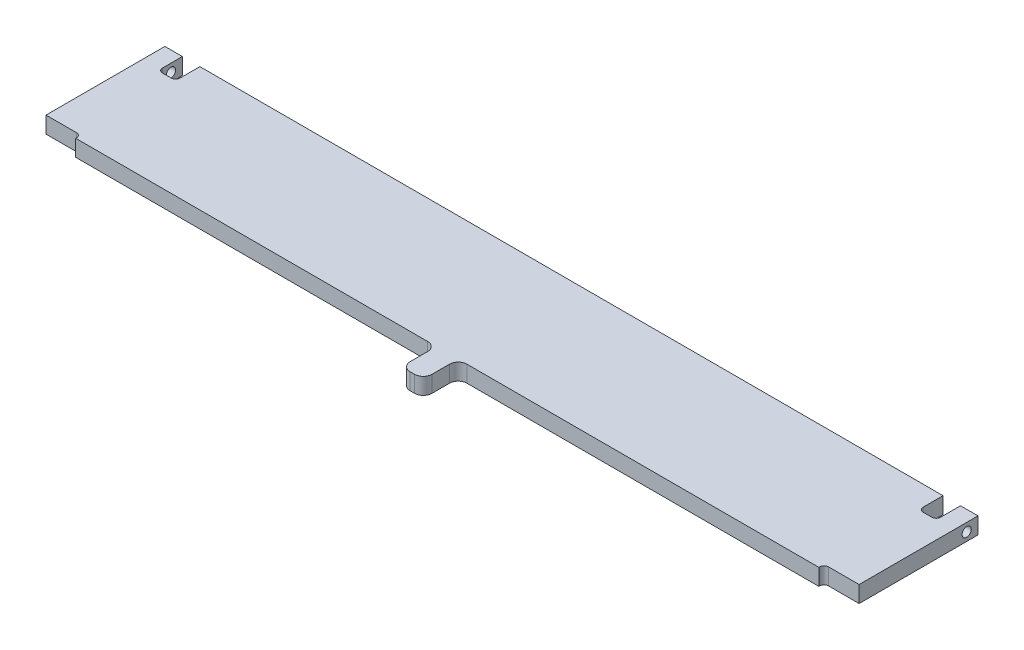
ISO-10303-21;
HEADER;
FILE_DESCRIPTION(('STEP AP214'),'2;1');
FILE_NAME('part.step','',(''),(''),'','','');
FILE_SCHEMA(('AUTOMOTIVE_DESIGN { 1 0 10303 214 1 1 1 1 }'));
ENDSEC;
DATA;
#1=APPLICATION_CONTEXT('core data for automotive mechanical design processes');
#2=APPLICATION_PROTOCOL_DEFINITION('international standard','automotive_design',2000,#1);
#3=PRODUCT_CONTEXT('',#1,'mechanical');
#4=PRODUCT('Part','Part','',(#3));
#5=PRODUCT_RELATED_PRODUCT_CATEGORY('part','',(#4));
#6=PRODUCT_DEFINITION_FORMATION('','',#4);
#7=PRODUCT_DEFINITION_CONTEXT('part definition',#1,'design');
#8=PRODUCT_DEFINITION('design','',#6,#7);
#9=PRODUCT_DEFINITION_SHAPE('','',#8);
#10=(LENGTH_UNIT() NAMED_UNIT(*) SI_UNIT(.MILLI.,.METRE.));
#11=(NAMED_UNIT(*) PLANE_ANGLE_UNIT() SI_UNIT($,.RADIAN.));
#12=(NAMED_UNIT(*) SI_UNIT($,.STERADIAN.) SOLID_ANGLE_UNIT());
#13=UNCERTAINTY_MEASURE_WITH_UNIT(LENGTH_MEASURE(1.E-05),#10,'distance_accuracy_value','');
#14=(GEOMETRIC_REPRESENTATION_CONTEXT(3) GLOBAL_UNCERTAINTY_ASSIGNED_CONTEXT((#13)) GLOBAL_UNIT_ASSIGNED_CONTEXT((#10,
#11,#12)) REPRESENTATION_CONTEXT('',''));
#15=CARTESIAN_POINT('',(0.,0.,0.));
#16=DIRECTION('',(0.,0.,1.));
#17=DIRECTION('',(1.,0.,0.));
#18=AXIS2_PLACEMENT_3D('',#15,#16,#17);
#19=CARTESIAN_POINT('',(269.875,-6.,45.085));
#20=DIRECTION('',(1.,0.,0.));
#21=DIRECTION('',(0.,0.,-1.));
#22=AXIS2_PLACEMENT_3D('',#19,#20,#21);
#23=PLANE('',#22);
#24=DIRECTION('',(0.,-1.,0.));
#25=VECTOR('',#24,1.);
#26=CARTESIAN_POINT('',(269.875,0.,45.085));
#27=LINE('',#26,#25);
#28=CARTESIAN_POINT('',(269.874999938617,6.,45.0849999915333));
#29=VERTEX_POINT('',#28);
#30=CARTESIAN_POINT('',(269.874999938617,-6.,45.0849999915333));
#31=VERTEX_POINT('',#30);
#32=EDGE_CURVE('E369',#29,#31,#27,.T.);
#33=ORIENTED_EDGE('',*,*,#32,.T.);
#34=DIRECTION('',(0.,0.,-1.));
#35=VECTOR('',#34,1.);
#36=CARTESIAN_POINT('',(269.875,-6.,44.7675));
#37=LINE('',#36,#35);
#38=CARTESIAN_POINT('',(269.875,-6.,44.4499999993893));
#39=VERTEX_POINT('',#38);
#40=EDGE_CURVE('E413',#31,#39,#37,.T.);
#41=ORIENTED_EDGE('',*,*,#40,.T.);
#42=DIRECTION('',(0.,1.,0.));
#43=VECTOR('',#42,1.);
#44=CARTESIAN_POINT('',(269.875,0.,44.4499999987786));
#45=LINE('',#44,#43);
#46=CARTESIAN_POINT('',(269.875,6.,44.4499999993893));
#47=VERTEX_POINT('',#46);
#48=EDGE_CURVE('E366',#47,#39,#45,.F.);
#49=ORIENTED_EDGE('',*,*,#48,.F.);
#50=DIRECTION('',(0.,0.,1.));
#51=VECTOR('',#50,1.);
#52=CARTESIAN_POINT('',(269.875,6.,44.7675));
#53=LINE('',#52,#51);
#54=EDGE_CURVE('E416',#47,#29,#53,.T.);
#55=ORIENTED_EDGE('',*,*,#54,.T.);
#56=EDGE_LOOP('',(#33,#41,#49,#55));
#57=FACE_BOUND('',#56,.T.);
#58=ADVANCED_FACE('F17',(#57),#23,.T.);
#59=CARTESIAN_POINT('',(282.575,0.,-36.83));
#60=DIRECTION('',(1.,0.,0.));
#61=DIRECTION('',(0.,0.,-1.));
#62=AXIS2_PLACEMENT_3D('',#59,#60,#61);
#63=CYLINDRICAL_SURFACE('',#62,3.36550000000001);
#64=CARTESIAN_POINT('',(295.275,0.,-36.83));
#65=DIRECTION('',(1.,0.,0.));
#66=DIRECTION('',(0.,0.,-1.));
#67=AXIS2_PLACEMENT_3D('',#64,#65,#66);
#68=CIRCLE('',#67,3.36550000000001);
#69=CARTESIAN_POINT('',(295.275,0.,-40.1955));
#70=VERTEX_POINT('',#69);
#71=EDGE_CURVE('E21',#70,#70,#68,.T.);
#72=ORIENTED_EDGE('',*,*,#71,.T.);
#73=EDGE_LOOP('',(#72));
#74=FACE_BOUND('',#73,.T.);
#75=CARTESIAN_POINT('',(282.575,0.,-36.83));
#76=DIRECTION('',(1.,0.,0.));
#77=DIRECTION('',(0.,0.,-1.));
#78=AXIS2_PLACEMENT_3D('',#75,#76,#77);
#79=CIRCLE('',#78,3.36550000000001);
#80=CARTESIAN_POINT('',(282.575,0.,-40.1955));
#81=VERTEX_POINT('',#80);
#82=EDGE_CURVE('E336',#81,#81,#79,.T.);
#83=ORIENTED_EDGE('',*,*,#82,.F.);
#84=EDGE_LOOP('',(#83));
#85=FACE_BOUND('',#84,.T.);
#86=ADVANCED_FACE('F485',(#74,#85),#63,.F.);
#87=CARTESIAN_POINT('',(-269.875,-6.,45.085));
#88=DIRECTION('',(1.,0.,0.));
#89=DIRECTION('',(0.,0.,-1.));
#90=AXIS2_PLACEMENT_3D('',#87,#88,#89);
#91=PLANE('',#90);
#92=DIRECTION('',(0.,1.,0.));
#93=VECTOR('',#92,1.);
#94=CARTESIAN_POINT('',(-269.875,0.,45.085));
#95=LINE('',#94,#93);
#96=CARTESIAN_POINT('',(-269.874999938617,-6.,45.0849999915333));
#97=VERTEX_POINT('',#96);
#98=CARTESIAN_POINT('',(-269.874999938617,6.,45.0849999915333));
#99=VERTEX_POINT('',#98);
#100=EDGE_CURVE('E290',#97,#99,#95,.T.);
#101=ORIENTED_EDGE('',*,*,#100,.T.);
#102=DIRECTION('',(0.,0.,1.));
#103=VECTOR('',#102,1.);
#104=CARTESIAN_POINT('',(-269.875,6.,44.7675));
#105=LINE('',#104,#103);
#106=CARTESIAN_POINT('',(-269.875,6.,44.4499999996744));
#107=VERTEX_POINT('',#106);
#108=EDGE_CURVE('E409',#107,#99,#105,.T.);
#109=ORIENTED_EDGE('',*,*,#108,.F.);
#110=DIRECTION('',(0.,-1.,0.));
#111=VECTOR('',#110,1.);
#112=CARTESIAN_POINT('',(-269.875,0.,44.4499999993488));
#113=LINE('',#112,#111);
#114=CARTESIAN_POINT('',(-269.875,-6.,44.4499999996744));
#115=VERTEX_POINT('',#114);
#116=EDGE_CURVE('E293',#115,#107,#113,.F.);
#117=ORIENTED_EDGE('',*,*,#116,.F.);
#118=DIRECTION('',(0.,0.,-1.));
#119=VECTOR('',#118,1.);
#120=CARTESIAN_POINT('',(-269.875,-6.,44.7675));
#121=LINE('',#120,#119);
#122=EDGE_CURVE('E387',#97,#115,#121,.T.);
#123=ORIENTED_EDGE('',*,*,#122,.F.);
#124=EDGE_LOOP('',(#101,#109,#117,#123));
#125=FACE_BOUND('',#124,.T.);
#126=ADVANCED_FACE('F487',(#125),#91,.F.);
#127=CARTESIAN_POINT('',(-1.5875,-6.,64.135));
#128=DIRECTION('',(0.,1.,0.));
#129=DIRECTION('',(0.,0.,1.));
#130=AXIS2_PLACEMENT_3D('',#127,#128,#129);
#131=CYLINDRICAL_SURFACE('',#130,6.35000000000001);
#132=CARTESIAN_POINT('',(-1.5875,6.,64.135));
#133=DIRECTION('',(0.,1.,0.));
#134=DIRECTION('',(0.,0.,1.));
#135=AXIS2_PLACEMENT_3D('',#132,#133,#134);
#136=CIRCLE('',#135,6.35000000000001);
#137=CARTESIAN_POINT('',(-7.93749993650001,6.,64.135));
#138=VERTEX_POINT('',#137);
#139=CARTESIAN_POINT('',(-1.5875,6.,70.485));
#140=VERTEX_POINT('',#139);
#141=EDGE_CURVE('E240',#138,#140,#136,.T.);
#142=ORIENTED_EDGE('',*,*,#141,.F.);
#143=DIRECTION('',(0.,-1.,0.));
#144=VECTOR('',#143,1.);
#145=CARTESIAN_POINT('',(-7.9375,0.,64.135));
#146=LINE('',#145,#144);
#147=CARTESIAN_POINT('',(-7.93749993650001,-6.,64.135));
#148=VERTEX_POINT('',#147);
#149=EDGE_CURVE('E236',#138,#148,#146,.T.);
#150=ORIENTED_EDGE('',*,*,#149,.T.);
#151=CARTESIAN_POINT('',(-1.5875,-6.,64.135));
#152=DIRECTION('',(0.,1.,0.));
#153=DIRECTION('',(0.,0.,1.));
#154=AXIS2_PLACEMENT_3D('',#151,#152,#153);
#155=CIRCLE('',#154,6.35000000000001);
#156=CARTESIAN_POINT('',(-1.5875,-6.,70.485));
#157=VERTEX_POINT('',#156);
#158=EDGE_CURVE('E389',#148,#157,#155,.T.);
#159=ORIENTED_EDGE('',*,*,#158,.T.);
#160=DIRECTION('',(0.,-1.,0.));
#161=VECTOR('',#160,1.);
#162=CARTESIAN_POINT('',(-1.5875,0.,70.485));
#163=LINE('',#162,#161);
#164=EDGE_CURVE('E385',#140,#157,#163,.T.);
#165=ORIENTED_EDGE('',*,*,#164,.F.);
#166=EDGE_LOOP('',(#142,#150,#159,#165));
#167=FACE_BOUND('',#166,.T.);
#168=ADVANCED_FACE('F495',(#167),#131,.T.);
#169=CARTESIAN_POINT('',(-1.5875,-6.,70.485));
#170=DIRECTION('',(0.,0.,1.));
#171=DIRECTION('',(1.,0.,0.));
#172=AXIS2_PLACEMENT_3D('',#169,#170,#171);
#173=PLANE('',#172);
#174=ORIENTED_EDGE('',*,*,#164,.T.);
#175=DIRECTION('',(1.,0.,0.));
#176=VECTOR('',#175,1.);
#177=CARTESIAN_POINT('',(0.,-6.,70.485));
#178=LINE('',#177,#176);
#179=CARTESIAN_POINT('',(1.58749999869759,-6.,70.485));
#180=VERTEX_POINT('',#179);
#181=EDGE_CURVE('E456',#157,#180,#178,.T.);
#182=ORIENTED_EDGE('',*,*,#181,.T.);
#183=DIRECTION('',(0.,-1.,0.));
#184=VECTOR('',#183,1.);
#185=CARTESIAN_POINT('',(1.58749999739519,0.,70.485));
#186=LINE('',#185,#184);
#187=CARTESIAN_POINT('',(1.58749999869759,6.,70.485));
#188=VERTEX_POINT('',#187);
#189=EDGE_CURVE('E382',#180,#188,#186,.F.);
#190=ORIENTED_EDGE('',*,*,#189,.T.);
#191=DIRECTION('',(1.,0.,0.));
#192=VECTOR('',#191,1.);
#193=CARTESIAN_POINT('',(0.,6.,70.485));
#194=LINE('',#193,#192);
#195=EDGE_CURVE('E242',#140,#188,#194,.T.);
#196=ORIENTED_EDGE('',*,*,#195,.F.);
#197=EDGE_LOOP('',(#174,#182,#190,#196));
#198=FACE_BOUND('',#197,.T.);
#199=ADVANCED_FACE('F553',(#198),#173,.T.);
#200=CARTESIAN_POINT('',(1.5875,6.,64.135));
#201=DIRECTION('',(0.,-1.,0.));
#202=DIRECTION('',(0.,0.,-1.));
#203=AXIS2_PLACEMENT_3D('',#200,#201,#202);
#204=CYLINDRICAL_SURFACE('',#203,6.34999999999999);
#205=CARTESIAN_POINT('',(1.5875,-6.,64.135));
#206=DIRECTION('',(0.,-1.,0.));
#207=DIRECTION('',(0.,0.,-1.));
#208=AXIS2_PLACEMENT_3D('',#205,#206,#207);
#209=CIRCLE('',#208,6.34999999999999);
#210=CARTESIAN_POINT('',(7.93749993650001,-6.,64.135));
#211=VERTEX_POINT('',#210);
#212=EDGE_CURVE('E453',#180,#211,#209,.F.);
#213=ORIENTED_EDGE('',*,*,#212,.T.);
#214=DIRECTION('',(0.,1.,0.));
#215=VECTOR('',#214,1.);
#216=CARTESIAN_POINT('',(7.9375,0.,64.135));
#217=LINE('',#216,#215);
#218=CARTESIAN_POINT('',(7.93749993650001,6.,64.135));
#219=VERTEX_POINT('',#218);
#220=EDGE_CURVE('E379',#211,#219,#217,.T.);
#221=ORIENTED_EDGE('',*,*,#220,.T.);
#222=CARTESIAN_POINT('',(1.5875,6.,64.135));
#223=DIRECTION('',(0.,-1.,0.));
#224=DIRECTION('',(0.,0.,-1.));
#225=AXIS2_PLACEMENT_3D('',#222,#223,#224);
#226=CIRCLE('',#225,6.34999999999999);
#227=EDGE_CURVE('E478',#188,#219,#226,.F.);
#228=ORIENTED_EDGE('',*,*,#227,.F.);
#229=ORIENTED_EDGE('',*,*,#189,.F.);
#230=EDGE_LOOP('',(#213,#221,#228,#229));
#231=FACE_BOUND('',#230,.T.);
#232=ADVANCED_FACE('F551',(#231),#204,.T.);
#233=CARTESIAN_POINT('',(7.9375,-6.,51.435));
#234=DIRECTION('',(-1.,0.,0.));
#235=DIRECTION('',(0.,0.,1.));
#236=AXIS2_PLACEMENT_3D('',#233,#234,#235);
#237=PLANE('',#236);
#238=DIRECTION('',(0.,1.,0.));
#239=VECTOR('',#238,1.);
#240=CARTESIAN_POINT('',(7.9375,0.,51.4350000024428));
#241=LINE('',#240,#239);
#242=CARTESIAN_POINT('',(7.93749993650001,6.,51.4350000012214));
#243=VERTEX_POINT('',#242);
#244=CARTESIAN_POINT('',(7.93749993650001,-6.,51.4350000012214));
#245=VERTEX_POINT('',#244);
#246=EDGE_CURVE('E373',#243,#245,#241,.F.);
#247=ORIENTED_EDGE('',*,*,#246,.F.);
#248=DIRECTION('',(0.,0.,-1.));
#249=VECTOR('',#248,1.);
#250=CARTESIAN_POINT('',(7.93749987300002,6.,12.7));
#251=LINE('',#250,#249);
#252=EDGE_CURVE('E477',#219,#243,#251,.T.);
#253=ORIENTED_EDGE('',*,*,#252,.F.);
#254=ORIENTED_EDGE('',*,*,#220,.F.);
#255=DIRECTION('',(0.,0.,-1.));
#256=VECTOR('',#255,1.);
#257=CARTESIAN_POINT('',(7.93749987300002,-6.,12.7));
#258=LINE('',#257,#256);
#259=EDGE_CURVE('E452',#211,#245,#258,.T.);
#260=ORIENTED_EDGE('',*,*,#259,.T.);
#261=EDGE_LOOP('',(#247,#253,#254,#260));
#262=FACE_BOUND('',#261,.T.);
#263=ADVANCED_FACE('F549',(#262),#237,.F.);
#264=CARTESIAN_POINT('',(14.2875,6.,51.435));
#265=DIRECTION('',(0.,-1.,0.));
#266=DIRECTION('',(0.,0.,-1.));
#267=AXIS2_PLACEMENT_3D('',#264,#265,#266);
#268=CYLINDRICAL_SURFACE('',#267,6.35);
#269=CARTESIAN_POINT('',(14.2875,-6.,51.435));
#270=DIRECTION('',(0.,-1.,0.));
#271=DIRECTION('',(0.,0.,-1.));
#272=AXIS2_PLACEMENT_3D('',#269,#270,#271);
#273=CIRCLE('',#272,6.35);
#274=CARTESIAN_POINT('',(14.2875,-6.,45.0849999873));
#275=VERTEX_POINT('',#274);
#276=EDGE_CURVE('E449',#245,#275,#273,.T.);
#277=ORIENTED_EDGE('',*,*,#276,.T.);
#278=DIRECTION('',(0.,1.,0.));
#279=VECTOR('',#278,1.);
#280=CARTESIAN_POINT('',(14.2875,0.,45.085));
#281=LINE('',#280,#279);
#282=CARTESIAN_POINT('',(14.2875,6.,45.0849999873));
#283=VERTEX_POINT('',#282);
#284=EDGE_CURVE('E370',#275,#283,#281,.T.);
#285=ORIENTED_EDGE('',*,*,#284,.T.);
#286=CARTESIAN_POINT('',(14.2875,6.,51.435));
#287=DIRECTION('',(0.,-1.,0.));
#288=DIRECTION('',(0.,0.,-1.));
#289=AXIS2_PLACEMENT_3D('',#286,#287,#288);
#290=CIRCLE('',#289,6.35);
#291=EDGE_CURVE('E475',#243,#283,#290,.T.);
#292=ORIENTED_EDGE('',*,*,#291,.F.);
#293=ORIENTED_EDGE('',*,*,#246,.T.);
#294=EDGE_LOOP('',(#277,#285,#292,#293));
#295=FACE_BOUND('',#294,.T.);
#296=ADVANCED_FACE('F546',(#295),#268,.F.);
#297=CARTESIAN_POINT('',(269.875,-6.,45.085));
#298=DIRECTION('',(0.,0.,-1.));
#299=DIRECTION('',(-1.,0.,0.));
#300=AXIS2_PLACEMENT_3D('',#297,#298,#299);
#301=PLANE('',#300);
#302=ORIENTED_EDGE('',*,*,#32,.F.);
#303=DIRECTION('',(1.,0.,0.));
#304=VECTOR('',#303,1.);
#305=CARTESIAN_POINT('',(0.,6.,45.0849999746));
#306=LINE('',#305,#304);
#307=EDGE_CURVE('E474',#283,#29,#306,.T.);
#308=ORIENTED_EDGE('',*,*,#307,.F.);
#309=ORIENTED_EDGE('',*,*,#284,.F.);
#310=DIRECTION('',(1.,0.,0.));
#311=VECTOR('',#310,1.);
#312=CARTESIAN_POINT('',(0.,-6.,45.0849999746));
#313=LINE('',#312,#311);
#314=EDGE_CURVE('E448',#275,#31,#313,.T.);
#315=ORIENTED_EDGE('',*,*,#314,.T.);
#316=EDGE_LOOP('',(#302,#308,#309,#315));
#317=FACE_BOUND('',#316,.T.);
#318=ADVANCED_FACE('F544',(#317),#301,.F.);
#319=CARTESIAN_POINT('',(273.05,-6.,44.45));
#320=DIRECTION('',(0.,1.,0.));
#321=DIRECTION('',(0.,0.,1.));
#322=AXIS2_PLACEMENT_3D('',#319,#320,#321);
#323=CYLINDRICAL_SURFACE('',#322,3.17500000000001);
#324=CARTESIAN_POINT('',(273.05,6.,44.45));
#325=DIRECTION('',(0.,1.,0.));
#326=DIRECTION('',(0.,0.,1.));
#327=AXIS2_PLACEMENT_3D('',#324,#325,#326);
#328=CIRCLE('',#327,3.17500000000001);
#329=CARTESIAN_POINT('',(273.05,6.,41.274999985395));
#330=VERTEX_POINT('',#329);
#331=EDGE_CURVE('E472',#47,#330,#328,.F.);
#332=ORIENTED_EDGE('',*,*,#331,.F.);
#333=ORIENTED_EDGE('',*,*,#48,.T.);
#334=CARTESIAN_POINT('',(273.05,-6.,44.45));
#335=DIRECTION('',(0.,1.,0.));
#336=DIRECTION('',(0.,0.,1.));
#337=AXIS2_PLACEMENT_3D('',#334,#335,#336);
#338=CIRCLE('',#337,3.17500000000001);
#339=CARTESIAN_POINT('',(273.05,-6.,41.274999985395));
#340=VERTEX_POINT('',#339);
#341=EDGE_CURVE('E445',#39,#340,#338,.F.);
#342=ORIENTED_EDGE('',*,*,#341,.T.);
#343=DIRECTION('',(0.,1.,0.));
#344=VECTOR('',#343,1.);
#345=CARTESIAN_POINT('',(273.05,0.,41.275));
#346=LINE('',#345,#344);
#347=EDGE_CURVE('E361',#340,#330,#346,.T.);
#348=ORIENTED_EDGE('',*,*,#347,.T.);
#349=EDGE_LOOP('',(#332,#333,#342,#348));
#350=FACE_BOUND('',#349,.T.);
#351=ADVANCED_FACE('F540',(#350),#323,.F.);
#352=CARTESIAN_POINT('',(295.275,-6.,41.275));
#353=DIRECTION('',(0.,0.,-1.));
#354=DIRECTION('',(-1.,0.,0.));
#355=AXIS2_PLACEMENT_3D('',#352,#353,#354);
#356=PLANE('',#355);
#357=DIRECTION('',(0.,1.,0.));
#358=VECTOR('',#357,1.);
#359=CARTESIAN_POINT('',(295.275,0.,41.275));
#360=LINE('',#359,#358);
#361=CARTESIAN_POINT('',(295.275,-6.,41.2749999805267));
#362=VERTEX_POINT('',#361);
#363=CARTESIAN_POINT('',(295.275,6.,41.2749999805267));
#364=VERTEX_POINT('',#363);
#365=EDGE_CURVE('E358',#362,#364,#360,.T.);
#366=ORIENTED_EDGE('',*,*,#365,.T.);
#367=DIRECTION('',(1.,0.,0.));
#368=VECTOR('',#367,1.);
#369=CARTESIAN_POINT('',(0.,6.,41.27499997079));
#370=LINE('',#369,#368);
#371=EDGE_CURVE('E405',#330,#364,#370,.T.);
#372=ORIENTED_EDGE('',*,*,#371,.F.);
#373=ORIENTED_EDGE('',*,*,#347,.F.);
#374=DIRECTION('',(1.,0.,0.));
#375=VECTOR('',#374,1.);
#376=CARTESIAN_POINT('',(0.,-6.,41.27499997079));
#377=LINE('',#376,#375);
#378=EDGE_CURVE('E355',#340,#362,#377,.T.);
#379=ORIENTED_EDGE('',*,*,#378,.T.);
#380=EDGE_LOOP('',(#366,#372,#373,#379));
#381=FACE_BOUND('',#380,.T.);
#382=ADVANCED_FACE('F543',(#381),#356,.F.);
#383=CARTESIAN_POINT('',(295.275,-6.,-45.085));
#384=DIRECTION('',(-1.,0.,0.));
#385=DIRECTION('',(0.,0.,1.));
#386=AXIS2_PLACEMENT_3D('',#383,#384,#385);
#387=PLANE('',#386);
#388=ORIENTED_EDGE('',*,*,#71,.F.);
#389=EDGE_LOOP('',(#388));
#390=FACE_BOUND('',#389,.T.);
#391=DIRECTION('',(0.,1.,0.));
#392=VECTOR('',#391,1.);
#393=CARTESIAN_POINT('',(295.275,0.,-45.085));
#394=LINE('',#393,#392);
#395=CARTESIAN_POINT('',(295.275,-6.,-45.085));
#396=VERTEX_POINT('',#395);
#397=CARTESIAN_POINT('',(295.275,6.,-45.085));
#398=VERTEX_POINT('',#397);
#399=EDGE_CURVE('E339',#396,#398,#394,.T.);
#400=ORIENTED_EDGE('',*,*,#399,.T.);
#401=DIRECTION('',(0.,0.,-1.));
#402=VECTOR('',#401,1.);
#403=CARTESIAN_POINT('',(295.275,6.,12.7));
#404=LINE('',#403,#402);
#405=EDGE_CURVE('E401',#364,#398,#404,.T.);
#406=ORIENTED_EDGE('',*,*,#405,.F.);
#407=ORIENTED_EDGE('',*,*,#365,.F.);
#408=DIRECTION('',(0.,0.,-1.));
#409=VECTOR('',#408,1.);
#410=CARTESIAN_POINT('',(295.275,-6.,12.7));
#411=LINE('',#410,#409);
#412=EDGE_CURVE('E346',#362,#396,#411,.T.);
#413=ORIENTED_EDGE('',*,*,#412,.T.);
#414=EDGE_LOOP('',(#400,#406,#407,#413));
#415=FACE_BOUND('',#414,.T.);
#416=ADVANCED_FACE('F646',(#390,#415),#387,.F.);
#417=CARTESIAN_POINT('',(282.575,-6.,-45.085));
#418=DIRECTION('',(0.,0.,1.));
#419=DIRECTION('',(1.,0.,0.));
#420=AXIS2_PLACEMENT_3D('',#417,#418,#419);
#421=PLANE('',#420);
#422=DIRECTION('',(-1.,0.,0.));
#423=VECTOR('',#422,1.);
#424=CARTESIAN_POINT('',(0.,-6.,-45.085));
#425=LINE('',#424,#423);
#426=CARTESIAN_POINT('',(282.575000135467,-6.,-45.085));
#427=VERTEX_POINT('',#426);
#428=EDGE_CURVE('E342',#396,#427,#425,.T.);
#429=ORIENTED_EDGE('',*,*,#428,.T.);
#430=DIRECTION('',(0.,-1.,0.));
#431=VECTOR('',#430,1.);
#432=CARTESIAN_POINT('',(282.575,0.,-45.085));
#433=LINE('',#432,#431);
#434=CARTESIAN_POINT('',(282.5750001016,6.,-45.085));
#435=VERTEX_POINT('',#434);
#436=EDGE_CURVE('E337',#435,#427,#433,.T.);
#437=ORIENTED_EDGE('',*,*,#436,.F.);
#438=DIRECTION('',(-1.,0.,0.));
#439=VECTOR('',#438,1.);
#440=CARTESIAN_POINT('',(0.,6.,-45.085));
#441=LINE('',#440,#439);
#442=EDGE_CURVE('E398',#398,#435,#441,.T.);
#443=ORIENTED_EDGE('',*,*,#442,.F.);
#444=ORIENTED_EDGE('',*,*,#399,.F.);
#445=EDGE_LOOP('',(#429,#437,#443,#444));
#446=FACE_BOUND('',#445,.T.);
#447=ADVANCED_FACE('F651',(#446),#421,.F.);
#448=CARTESIAN_POINT('',(282.575,-6.,-45.085));
#449=DIRECTION('',(-1.,0.,0.));
#450=DIRECTION('',(0.,0.,1.));
#451=AXIS2_PLACEMENT_3D('',#448,#449,#450);
#452=PLANE('',#451);
#453=ORIENTED_EDGE('',*,*,#82,.T.);
#454=EDGE_LOOP('',(#453));
#455=FACE_BOUND('',#454,.T.);
#456=ORIENTED_EDGE('',*,*,#436,.T.);
#457=DIRECTION('',(0.,0.,1.));
#458=VECTOR('',#457,1.);
#459=CARTESIAN_POINT('',(282.5750002032,-6.,12.7));
#460=LINE('',#459,#458);
#461=CARTESIAN_POINT('',(282.5750001016,-6.,-30.6387500003256));
#462=VERTEX_POINT('',#461);
#463=EDGE_CURVE('E345',#427,#462,#460,.T.);
#464=ORIENTED_EDGE('',*,*,#463,.T.);
#465=DIRECTION('',(0.,1.,0.));
#466=VECTOR('',#465,1.);
#467=CARTESIAN_POINT('',(282.575,0.,-30.6387500006512));
#468=LINE('',#467,#466);
#469=CARTESIAN_POINT('',(282.5750001016,6.,-30.6387500003256));
#470=VERTEX_POINT('',#469);
#471=EDGE_CURVE('E334',#470,#462,#468,.F.);
#472=ORIENTED_EDGE('',*,*,#471,.F.);
#473=DIRECTION('',(0.,0.,1.));
#474=VECTOR('',#473,1.);
#475=CARTESIAN_POINT('',(282.5750002032,6.,12.7));
#476=LINE('',#475,#474);
#477=EDGE_CURVE('E400',#435,#470,#476,.T.);
#478=ORIENTED_EDGE('',*,*,#477,.F.);
#479=EDGE_LOOP('',(#456,#464,#472,#478));
#480=FACE_BOUND('',#479,.T.);
#481=ADVANCED_FACE('F482',(#455,#480),#452,.T.);
#482=CARTESIAN_POINT('',(279.4,-6.,-30.63875));
#483=DIRECTION('',(0.,1.,0.));
#484=DIRECTION('',(0.,0.,1.));
#485=AXIS2_PLACEMENT_3D('',#482,#483,#484);
#486=CYLINDRICAL_SURFACE('',#485,3.175);
#487=CARTESIAN_POINT('',(279.4,6.,-30.63875));
#488=DIRECTION('',(0.,1.,0.));
#489=DIRECTION('',(0.,0.,1.));
#490=AXIS2_PLACEMENT_3D('',#487,#488,#489);
#491=CIRCLE('',#490,3.175);
#492=CARTESIAN_POINT('',(279.4,6.,-27.463750027305));
#493=VERTEX_POINT('',#492);
#494=EDGE_CURVE('E470',#470,#493,#491,.F.);
#495=ORIENTED_EDGE('',*,*,#494,.F.);
#496=ORIENTED_EDGE('',*,*,#471,.T.);
#497=CARTESIAN_POINT('',(279.4,-6.,-30.63875));
#498=DIRECTION('',(0.,1.,0.));
#499=DIRECTION('',(0.,0.,1.));
#500=AXIS2_PLACEMENT_3D('',#497,#498,#499);
#501=CIRCLE('',#500,3.175);
#502=CARTESIAN_POINT('',(279.4,-6.,-27.463750027305));
#503=VERTEX_POINT('',#502);
#504=EDGE_CURVE('E442',#462,#503,#501,.F.);
#505=ORIENTED_EDGE('',*,*,#504,.T.);
#506=DIRECTION('',(0.,-1.,0.));
#507=VECTOR('',#506,1.);
#508=CARTESIAN_POINT('',(279.4,0.,-27.46375));
#509=LINE('',#508,#507);
#510=EDGE_CURVE('E332',#493,#503,#509,.T.);
#511=ORIENTED_EDGE('',*,*,#510,.F.);
#512=EDGE_LOOP('',(#495,#496,#505,#511));
#513=FACE_BOUND('',#512,.T.);
#514=ADVANCED_FACE('F536',(#513),#486,.F.);
#515=CARTESIAN_POINT('',(279.4,-6.,-27.46375));
#516=DIRECTION('',(0.,0.,-1.));
#517=DIRECTION('',(-1.,0.,0.));
#518=AXIS2_PLACEMENT_3D('',#515,#516,#517);
#519=PLANE('',#518);
#520=ORIENTED_EDGE('',*,*,#510,.T.);
#521=DIRECTION('',(-1.,0.,0.));
#522=VECTOR('',#521,1.);
#523=CARTESIAN_POINT('',(0.,-6.,-27.46375005461));
#524=LINE('',#523,#522);
#525=CARTESIAN_POINT('',(273.049999999715,-6.,-27.463750027305));
#526=VERTEX_POINT('',#525);
#527=EDGE_CURVE('E441',#503,#526,#524,.T.);
#528=ORIENTED_EDGE('',*,*,#527,.T.);
#529=DIRECTION('',(0.,1.,0.));
#530=VECTOR('',#529,1.);
#531=CARTESIAN_POINT('',(273.04999999943,0.,-27.46375));
#532=LINE('',#531,#530);
#533=CARTESIAN_POINT('',(273.049999999715,6.,-27.463750027305));
#534=VERTEX_POINT('',#533);
#535=EDGE_CURVE('E330',#534,#526,#532,.F.);
#536=ORIENTED_EDGE('',*,*,#535,.F.);
#537=DIRECTION('',(-1.,0.,0.));
#538=VECTOR('',#537,1.);
#539=CARTESIAN_POINT('',(0.,6.,-27.46375005461));
#540=LINE('',#539,#538);
#541=EDGE_CURVE('E469',#493,#534,#540,.T.);
#542=ORIENTED_EDGE('',*,*,#541,.F.);
#543=EDGE_LOOP('',(#520,#528,#536,#542));
#544=FACE_BOUND('',#543,.T.);
#545=ADVANCED_FACE('F534',(#544),#519,.T.);
#546=CARTESIAN_POINT('',(273.05,-6.,-30.63875));
#547=DIRECTION('',(0.,1.,0.));
#548=DIRECTION('',(0.,0.,1.));
#549=AXIS2_PLACEMENT_3D('',#546,#547,#548);
#550=CYLINDRICAL_SURFACE('',#549,3.175);
#551=CARTESIAN_POINT('',(273.05,6.,-30.63875));
#552=DIRECTION('',(0.,1.,0.));
#553=DIRECTION('',(0.,0.,1.));
#554=AXIS2_PLACEMENT_3D('',#551,#552,#553);
#555=CIRCLE('',#554,3.175);
#556=CARTESIAN_POINT('',(269.874999907925,6.,-30.63875));
#557=VERTEX_POINT('',#556);
#558=EDGE_CURVE('E467',#534,#557,#555,.F.);
#559=ORIENTED_EDGE('',*,*,#558,.F.);
#560=ORIENTED_EDGE('',*,*,#535,.T.);
#561=CARTESIAN_POINT('',(273.05,-6.,-30.63875));
#562=DIRECTION('',(0.,1.,0.));
#563=DIRECTION('',(0.,0.,1.));
#564=AXIS2_PLACEMENT_3D('',#561,#562,#563);
#565=CIRCLE('',#564,3.175);
#566=CARTESIAN_POINT('',(269.874999907925,-6.,-30.63875));
#567=VERTEX_POINT('',#566);
#568=EDGE_CURVE('E438',#526,#567,#565,.F.);
#569=ORIENTED_EDGE('',*,*,#568,.T.);
#570=DIRECTION('',(0.,-1.,0.));
#571=VECTOR('',#570,1.);
#572=CARTESIAN_POINT('',(269.875,0.,-30.63875));
#573=LINE('',#572,#571);
#574=EDGE_CURVE('E326',#557,#567,#573,.T.);
#575=ORIENTED_EDGE('',*,*,#574,.F.);
#576=EDGE_LOOP('',(#559,#560,#569,#575));
#577=FACE_BOUND('',#576,.T.);
#578=ADVANCED_FACE('F530',(#577),#550,.F.);
#579=CARTESIAN_POINT('',(269.875,-6.,-30.63875));
#580=DIRECTION('',(1.,0.,0.));
#581=DIRECTION('',(0.,0.,-1.));
#582=AXIS2_PLACEMENT_3D('',#579,#580,#581);
#583=PLANE('',#582);
#584=ORIENTED_EDGE('',*,*,#574,.T.);
#585=DIRECTION('',(0.,0.,-1.));
#586=VECTOR('',#585,1.);
#587=CARTESIAN_POINT('',(269.87499981585,-6.,12.7));
#588=LINE('',#587,#586);
#589=CARTESIAN_POINT('',(269.874999877233,-6.,-45.085));
#590=VERTEX_POINT('',#589);
#591=EDGE_CURVE('E321',#567,#590,#588,.T.);
#592=ORIENTED_EDGE('',*,*,#591,.T.);
#593=DIRECTION('',(0.,1.,0.));
#594=VECTOR('',#593,1.);
#595=CARTESIAN_POINT('',(269.875,0.,-45.085));
#596=LINE('',#595,#594);
#597=CARTESIAN_POINT('',(269.874999877233,6.,-45.085));
#598=VERTEX_POINT('',#597);
#599=EDGE_CURVE('E314',#590,#598,#596,.T.);
#600=ORIENTED_EDGE('',*,*,#599,.T.);
#601=DIRECTION('',(0.,0.,-1.));
#602=VECTOR('',#601,1.);
#603=CARTESIAN_POINT('',(269.87499981585,6.,12.7));
#604=LINE('',#603,#602);
#605=EDGE_CURVE('E395',#557,#598,#604,.T.);
#606=ORIENTED_EDGE('',*,*,#605,.F.);
#607=EDGE_LOOP('',(#584,#592,#600,#606));
#608=FACE_BOUND('',#607,.T.);
#609=ADVANCED_FACE('F533',(#608),#583,.T.);
#610=CARTESIAN_POINT('',(-269.875,-6.,-45.085));
#611=DIRECTION('',(0.,0.,1.));
#612=DIRECTION('',(1.,0.,0.));
#613=AXIS2_PLACEMENT_3D('',#610,#611,#612);
#614=PLANE('',#613);
#615=ORIENTED_EDGE('',*,*,#599,.F.);
#616=DIRECTION('',(-1.,0.,0.));
#617=VECTOR('',#616,1.);
#618=CARTESIAN_POINT('',(0.,-6.,-45.085));
#619=LINE('',#618,#617);
#620=CARTESIAN_POINT('',(-269.874999877233,-6.,-45.085));
#621=VERTEX_POINT('',#620);
#622=EDGE_CURVE('E317',#590,#621,#619,.T.);
#623=ORIENTED_EDGE('',*,*,#622,.T.);
#624=DIRECTION('',(0.,1.,0.));
#625=VECTOR('',#624,1.);
#626=CARTESIAN_POINT('',(-269.875,0.,-45.085));
#627=LINE('',#626,#625);
#628=CARTESIAN_POINT('',(-269.874999907925,6.,-45.085));
#629=VERTEX_POINT('',#628);
#630=EDGE_CURVE('E311',#621,#629,#627,.T.);
#631=ORIENTED_EDGE('',*,*,#630,.T.);
#632=DIRECTION('',(-1.,0.,0.));
#633=VECTOR('',#632,1.);
#634=CARTESIAN_POINT('',(0.,6.,-45.085));
#635=LINE('',#634,#633);
#636=EDGE_CURVE('E392',#598,#629,#635,.T.);
#637=ORIENTED_EDGE('',*,*,#636,.F.);
#638=EDGE_LOOP('',(#615,#623,#631,#637));
#639=FACE_BOUND('',#638,.T.);
#640=ADVANCED_FACE('F671',(#639),#614,.F.);
#641=CARTESIAN_POINT('',(-269.875,-6.,-30.63875));
#642=DIRECTION('',(1.,0.,0.));
#643=DIRECTION('',(0.,0.,-1.));
#644=AXIS2_PLACEMENT_3D('',#641,#642,#643);
#645=PLANE('',#644);
#646=DIRECTION('',(0.,1.,0.));
#647=VECTOR('',#646,1.);
#648=CARTESIAN_POINT('',(-269.875,0.,-30.6387500006512));
#649=LINE('',#648,#647);
#650=CARTESIAN_POINT('',(-269.874999907925,6.,-30.6387500003256));
#651=VERTEX_POINT('',#650);
#652=CARTESIAN_POINT('',(-269.874999907925,-6.,-30.6387500003256));
#653=VERTEX_POINT('',#652);
#654=EDGE_CURVE('E309',#651,#653,#649,.F.);
#655=ORIENTED_EDGE('',*,*,#654,.F.);
#656=DIRECTION('',(0.,0.,1.));
#657=VECTOR('',#656,1.);
#658=CARTESIAN_POINT('',(-269.87499981585,6.,12.7));
#659=LINE('',#658,#657);
#660=EDGE_CURVE('E394',#629,#651,#659,.T.);
#661=ORIENTED_EDGE('',*,*,#660,.F.);
#662=ORIENTED_EDGE('',*,*,#630,.F.);
#663=DIRECTION('',(0.,0.,1.));
#664=VECTOR('',#663,1.);
#665=CARTESIAN_POINT('',(-269.87499981585,-6.,12.7));
#666=LINE('',#665,#664);
#667=EDGE_CURVE('E320',#621,#653,#666,.T.);
#668=ORIENTED_EDGE('',*,*,#667,.T.);
#669=EDGE_LOOP('',(#655,#661,#662,#668));
#670=FACE_BOUND('',#669,.T.);
#671=ADVANCED_FACE('F528',(#670),#645,.F.);
#672=CARTESIAN_POINT('',(-273.05,-6.,-30.63875));
#673=DIRECTION('',(0.,1.,0.));
#674=DIRECTION('',(0.,0.,1.));
#675=AXIS2_PLACEMENT_3D('',#672,#673,#674);
#676=CYLINDRICAL_SURFACE('',#675,3.175);
#677=CARTESIAN_POINT('',(-273.05,6.,-30.63875));
#678=DIRECTION('',(0.,1.,0.));
#679=DIRECTION('',(0.,0.,1.));
#680=AXIS2_PLACEMENT_3D('',#677,#678,#679);
#681=CIRCLE('',#680,3.175);
#682=CARTESIAN_POINT('',(-273.05,6.,-27.463750027305));
#683=VERTEX_POINT('',#682);
#684=EDGE_CURVE('E465',#651,#683,#681,.F.);
#685=ORIENTED_EDGE('',*,*,#684,.F.);
#686=ORIENTED_EDGE('',*,*,#654,.T.);
#687=CARTESIAN_POINT('',(-273.05,-6.,-30.63875));
#688=DIRECTION('',(0.,1.,0.));
#689=DIRECTION('',(0.,0.,1.));
#690=AXIS2_PLACEMENT_3D('',#687,#688,#689);
#691=CIRCLE('',#690,3.175);
#692=CARTESIAN_POINT('',(-273.05,-6.,-27.463750027305));
#693=VERTEX_POINT('',#692);
#694=EDGE_CURVE('E435',#653,#693,#691,.F.);
#695=ORIENTED_EDGE('',*,*,#694,.T.);
#696=DIRECTION('',(0.,1.,0.));
#697=VECTOR('',#696,1.);
#698=CARTESIAN_POINT('',(-273.05,0.,-27.46375));
#699=LINE('',#698,#697);
#700=EDGE_CURVE('E298',#693,#683,#699,.T.);
#701=ORIENTED_EDGE('',*,*,#700,.T.);
#702=EDGE_LOOP('',(#685,#686,#695,#701));
#703=FACE_BOUND('',#702,.T.);
#704=ADVANCED_FACE('F525',(#703),#676,.F.);
#705=CARTESIAN_POINT('',(-279.4,-6.,-27.46375));
#706=DIRECTION('',(0.,0.,1.));
#707=DIRECTION('',(1.,0.,0.));
#708=AXIS2_PLACEMENT_3D('',#705,#706,#707);
#709=PLANE('',#708);
#710=DIRECTION('',(0.,1.,0.));
#711=VECTOR('',#710,1.);
#712=CARTESIAN_POINT('',(-279.40000000057,0.,-27.46375));
#713=LINE('',#712,#711);
#714=CARTESIAN_POINT('',(-279.400000000285,6.,-27.463750027305));
#715=VERTEX_POINT('',#714);
#716=CARTESIAN_POINT('',(-279.400000000285,-6.,-27.463750027305));
#717=VERTEX_POINT('',#716);
#718=EDGE_CURVE('E226',#715,#717,#713,.F.);
#719=ORIENTED_EDGE('',*,*,#718,.F.);
#720=DIRECTION('',(-1.,0.,0.));
#721=VECTOR('',#720,1.);
#722=CARTESIAN_POINT('',(0.,6.,-27.46375005461));
#723=LINE('',#722,#721);
#724=EDGE_CURVE('E464',#683,#715,#723,.T.);
#725=ORIENTED_EDGE('',*,*,#724,.F.);
#726=ORIENTED_EDGE('',*,*,#700,.F.);
#727=DIRECTION('',(-1.,0.,0.));
#728=VECTOR('',#727,1.);
#729=CARTESIAN_POINT('',(0.,-6.,-27.46375005461));
#730=LINE('',#729,#728);
#731=EDGE_CURVE('E434',#693,#717,#730,.T.);
#732=ORIENTED_EDGE('',*,*,#731,.T.);
#733=EDGE_LOOP('',(#719,#725,#726,#732));
#734=FACE_BOUND('',#733,.T.);
#735=ADVANCED_FACE('F523',(#734),#709,.F.);
#736=CARTESIAN_POINT('',(-273.05,-6.,44.45));
#737=DIRECTION('',(0.,1.,0.));
#738=DIRECTION('',(0.,0.,1.));
#739=AXIS2_PLACEMENT_3D('',#736,#737,#738);
#740=CYLINDRICAL_SURFACE('',#739,3.17500000000001);
#741=CARTESIAN_POINT('',(-273.05,6.,44.45));
#742=DIRECTION('',(0.,1.,0.));
#743=DIRECTION('',(0.,0.,1.));
#744=AXIS2_PLACEMENT_3D('',#741,#742,#743);
#745=CIRCLE('',#744,3.17500000000001);
#746=CARTESIAN_POINT('',(-273.05,6.,41.275));
#747=VERTEX_POINT('',#746);
#748=EDGE_CURVE('E459',#747,#107,#745,.F.);
#749=ORIENTED_EDGE('',*,*,#748,.F.);
#750=DIRECTION('',(0.,1.,0.));
#751=VECTOR('',#750,1.);
#752=CARTESIAN_POINT('',(-273.05,0.,41.275));
#753=LINE('',#752,#751);
#754=CARTESIAN_POINT('',(-273.05,-6.,41.274999985395));
#755=VERTEX_POINT('',#754);
#756=EDGE_CURVE('E299',#755,#747,#753,.T.);
#757=ORIENTED_EDGE('',*,*,#756,.F.);
#758=CARTESIAN_POINT('',(-273.05,-6.,44.45));
#759=DIRECTION('',(0.,1.,0.));
#760=DIRECTION('',(0.,0.,1.));
#761=AXIS2_PLACEMENT_3D('',#758,#759,#760);
#762=CIRCLE('',#761,3.17500000000001);
#763=EDGE_CURVE('E427',#755,#115,#762,.F.);
#764=ORIENTED_EDGE('',*,*,#763,.T.);
#765=ORIENTED_EDGE('',*,*,#116,.T.);
#766=EDGE_LOOP('',(#749,#757,#764,#765));
#767=FACE_BOUND('',#766,.T.);
#768=ADVANCED_FACE('F520',(#767),#740,.F.);
#769=CARTESIAN_POINT('',(-14.2875,-6.,45.085));
#770=DIRECTION('',(0.,0.,-1.));
#771=DIRECTION('',(-1.,0.,0.));
#772=AXIS2_PLACEMENT_3D('',#769,#770,#771);
#773=PLANE('',#772);
#774=ORIENTED_EDGE('',*,*,#100,.F.);
#775=DIRECTION('',(1.,0.,0.));
#776=VECTOR('',#775,1.);
#777=CARTESIAN_POINT('',(0.,-6.,45.0849999746));
#778=LINE('',#777,#776);
#779=CARTESIAN_POINT('',(-14.2875000013024,-6.,45.0849999873));
#780=VERTEX_POINT('',#779);
#781=EDGE_CURVE('E426',#97,#780,#778,.T.);
#782=ORIENTED_EDGE('',*,*,#781,.T.);
#783=DIRECTION('',(0.,1.,0.));
#784=VECTOR('',#783,1.);
#785=CARTESIAN_POINT('',(-14.2875000026048,0.,45.085));
#786=LINE('',#785,#784);
#787=CARTESIAN_POINT('',(-14.2875000013024,6.,45.0849999873));
#788=VERTEX_POINT('',#787);
#789=EDGE_CURVE('E212',#788,#780,#786,.F.);
#790=ORIENTED_EDGE('',*,*,#789,.F.);
#791=DIRECTION('',(1.,0.,0.));
#792=VECTOR('',#791,1.);
#793=CARTESIAN_POINT('',(0.,6.,45.0849999746));
#794=LINE('',#793,#792);
#795=EDGE_CURVE('E224',#99,#788,#794,.T.);
#796=ORIENTED_EDGE('',*,*,#795,.F.);
#797=EDGE_LOOP('',(#774,#782,#790,#796));
#798=FACE_BOUND('',#797,.T.);
#799=ADVANCED_FACE('F519',(#798),#773,.F.);
#800=CARTESIAN_POINT('',(-14.2875,-6.,51.435));
#801=DIRECTION('',(0.,1.,0.));
#802=DIRECTION('',(0.,0.,1.));
#803=AXIS2_PLACEMENT_3D('',#800,#801,#802);
#804=CYLINDRICAL_SURFACE('',#803,6.35);
#805=CARTESIAN_POINT('',(-14.2875,6.,51.435));
#806=DIRECTION('',(0.,1.,0.));
#807=DIRECTION('',(0.,0.,1.));
#808=AXIS2_PLACEMENT_3D('',#805,#806,#807);
#809=CIRCLE('',#808,6.35);
#810=CARTESIAN_POINT('',(-7.93749993650001,6.,51.435));
#811=VERTEX_POINT('',#810);
#812=EDGE_CURVE('E218',#788,#811,#809,.F.);
#813=ORIENTED_EDGE('',*,*,#812,.F.);
#814=ORIENTED_EDGE('',*,*,#789,.T.);
#815=CARTESIAN_POINT('',(-14.2875,-6.,51.435));
#816=DIRECTION('',(0.,1.,0.));
#817=DIRECTION('',(0.,0.,1.));
#818=AXIS2_PLACEMENT_3D('',#815,#816,#817);
#819=CIRCLE('',#818,6.35);
#820=CARTESIAN_POINT('',(-7.93749993650001,-6.,51.435));
#821=VERTEX_POINT('',#820);
#822=EDGE_CURVE('E232',#780,#821,#819,.F.);
#823=ORIENTED_EDGE('',*,*,#822,.T.);
#824=DIRECTION('',(0.,1.,0.));
#825=VECTOR('',#824,1.);
#826=CARTESIAN_POINT('',(-7.9375,0.,51.435));
#827=LINE('',#826,#825);
#828=EDGE_CURVE('E229',#821,#811,#827,.T.);
#829=ORIENTED_EDGE('',*,*,#828,.T.);
#830=EDGE_LOOP('',(#813,#814,#823,#829));
#831=FACE_BOUND('',#830,.T.);
#832=ADVANCED_FACE('F230',(#831),#804,.F.);
#833=CARTESIAN_POINT('',(-7.9375,-6.,64.135));
#834=DIRECTION('',(1.,0.,0.));
#835=DIRECTION('',(0.,0.,-1.));
#836=AXIS2_PLACEMENT_3D('',#833,#834,#835);
#837=PLANE('',#836);
#838=ORIENTED_EDGE('',*,*,#149,.F.);
#839=DIRECTION('',(0.,0.,1.));
#840=VECTOR('',#839,1.);
#841=CARTESIAN_POINT('',(-7.93749987300002,6.,12.7));
#842=LINE('',#841,#840);
#843=EDGE_CURVE('E222',#811,#138,#842,.T.);
#844=ORIENTED_EDGE('',*,*,#843,.F.);
#845=ORIENTED_EDGE('',*,*,#828,.F.);
#846=DIRECTION('',(0.,0.,1.));
#847=VECTOR('',#846,1.);
#848=CARTESIAN_POINT('',(-7.93749987300002,-6.,12.7));
#849=LINE('',#848,#847);
#850=EDGE_CURVE('E267',#821,#148,#849,.T.);
#851=ORIENTED_EDGE('',*,*,#850,.T.);
#852=EDGE_LOOP('',(#838,#844,#845,#851));
#853=FACE_BOUND('',#852,.T.);
#854=ADVANCED_FACE('F238',(#853),#837,.F.);
#855=CARTESIAN_POINT('',(-279.4,-6.,-30.63875));
#856=DIRECTION('',(0.,1.,0.));
#857=DIRECTION('',(0.,0.,1.));
#858=AXIS2_PLACEMENT_3D('',#855,#856,#857);
#859=CYLINDRICAL_SURFACE('',#858,3.175);
#860=CARTESIAN_POINT('',(-279.4,6.,-30.63875));
#861=DIRECTION('',(0.,1.,0.));
#862=DIRECTION('',(0.,0.,1.));
#863=AXIS2_PLACEMENT_3D('',#860,#861,#862);
#864=CIRCLE('',#863,3.175);
#865=CARTESIAN_POINT('',(-282.575,6.,-30.63875));
#866=VERTEX_POINT('',#865);
#867=EDGE_CURVE('E462',#715,#866,#864,.F.);
#868=ORIENTED_EDGE('',*,*,#867,.F.);
#869=ORIENTED_EDGE('',*,*,#718,.T.);
#870=CARTESIAN_POINT('',(-279.4,-6.,-30.63875));
#871=DIRECTION('',(0.,1.,0.));
#872=DIRECTION('',(0.,0.,1.));
#873=AXIS2_PLACEMENT_3D('',#870,#871,#872);
#874=CIRCLE('',#873,3.175);
#875=CARTESIAN_POINT('',(-282.575,-6.,-30.63875));
#876=VERTEX_POINT('',#875);
#877=EDGE_CURVE('E431',#717,#876,#874,.F.);
#878=ORIENTED_EDGE('',*,*,#877,.T.);
#879=DIRECTION('',(0.,1.,0.));
#880=VECTOR('',#879,1.);
#881=CARTESIAN_POINT('',(-282.575,0.,-30.63875));
#882=LINE('',#881,#880);
#883=EDGE_CURVE('E247',#876,#866,#882,.T.);
#884=ORIENTED_EDGE('',*,*,#883,.T.);
#885=EDGE_LOOP('',(#868,#869,#878,#884));
#886=FACE_BOUND('',#885,.T.);
#887=ADVANCED_FACE('F513',(#886),#859,.F.);
#888=CARTESIAN_POINT('',(-295.275,6.,-45.085));
#889=DIRECTION('',(0.,1.,0.));
#890=DIRECTION('',(0.,0.,1.));
#891=AXIS2_PLACEMENT_3D('',#888,#889,#890);
#892=PLANE('',#891);
#893=ORIENTED_EDGE('',*,*,#108,.T.);
#894=ORIENTED_EDGE('',*,*,#795,.T.);
#895=ORIENTED_EDGE('',*,*,#812,.T.);
#896=ORIENTED_EDGE('',*,*,#843,.T.);
#897=ORIENTED_EDGE('',*,*,#141,.T.);
#898=ORIENTED_EDGE('',*,*,#195,.T.);
#899=ORIENTED_EDGE('',*,*,#227,.T.);
#900=ORIENTED_EDGE('',*,*,#252,.T.);
#901=ORIENTED_EDGE('',*,*,#291,.T.);
#902=ORIENTED_EDGE('',*,*,#307,.T.);
#903=ORIENTED_EDGE('',*,*,#54,.F.);
#904=ORIENTED_EDGE('',*,*,#331,.T.);
#905=ORIENTED_EDGE('',*,*,#371,.T.);
#906=ORIENTED_EDGE('',*,*,#405,.T.);
#907=ORIENTED_EDGE('',*,*,#442,.T.);
#908=ORIENTED_EDGE('',*,*,#477,.T.);
#909=ORIENTED_EDGE('',*,*,#494,.T.);
#910=ORIENTED_EDGE('',*,*,#541,.T.);
#911=ORIENTED_EDGE('',*,*,#558,.T.);
#912=ORIENTED_EDGE('',*,*,#605,.T.);
#913=ORIENTED_EDGE('',*,*,#636,.T.);
#914=ORIENTED_EDGE('',*,*,#660,.T.);
#915=ORIENTED_EDGE('',*,*,#684,.T.);
#916=ORIENTED_EDGE('',*,*,#724,.T.);
#917=ORIENTED_EDGE('',*,*,#867,.T.);
#918=DIRECTION('',(0.,0.,-1.));
#919=VECTOR('',#918,1.);
#920=CARTESIAN_POINT('',(-282.575,6.,-37.861875));
#921=LINE('',#920,#919);
#922=CARTESIAN_POINT('',(-282.575,6.,-45.085));
#923=VERTEX_POINT('',#922);
#924=EDGE_CURVE('E250',#866,#923,#921,.T.);
#925=ORIENTED_EDGE('',*,*,#924,.T.);
#926=DIRECTION('',(-1.,0.,0.));
#927=VECTOR('',#926,1.);
#928=CARTESIAN_POINT('',(-288.925,6.,-45.085));
#929=LINE('',#928,#927);
#930=CARTESIAN_POINT('',(-295.275,6.,-45.085));
#931=VERTEX_POINT('',#930);
#932=EDGE_CURVE('E262',#923,#931,#929,.T.);
#933=ORIENTED_EDGE('',*,*,#932,.T.);
#934=DIRECTION('',(0.,0.,1.));
#935=VECTOR('',#934,1.);
#936=CARTESIAN_POINT('',(-295.275,6.,-1.905));
#937=LINE('',#936,#935);
#938=CARTESIAN_POINT('',(-295.275,6.,41.2749999951317));
#939=VERTEX_POINT('',#938);
#940=EDGE_CURVE('E254',#931,#939,#937,.T.);
#941=ORIENTED_EDGE('',*,*,#940,.T.);
#942=DIRECTION('',(-1.,0.,0.));
#943=VECTOR('',#942,1.);
#944=CARTESIAN_POINT('',(-284.1625,6.,41.275));
#945=LINE('',#944,#943);
#946=EDGE_CURVE('E301',#747,#939,#945,.T.);
#947=ORIENTED_EDGE('',*,*,#946,.F.);
#948=ORIENTED_EDGE('',*,*,#748,.T.);
#949=EDGE_LOOP('',(#893,#894,#895,#896,#897,#898,#899,#900,#901,#902,#903,#904,#905,#906,#907,
#908,#909,#910,#911,#912,#913,#914,#915,#916,#917,#925,#933,#941,#947,#948));
#950=FACE_BOUND('',#949,.T.);
#951=ADVANCED_FACE('F220',(#950),#892,.T.);
#952=CARTESIAN_POINT('',(-295.275,-6.,41.275));
#953=DIRECTION('',(0.,0.,1.));
#954=DIRECTION('',(1.,0.,0.));
#955=AXIS2_PLACEMENT_3D('',#952,#953,#954);
#956=PLANE('',#955);
#957=DIRECTION('',(0.,-1.,0.));
#958=VECTOR('',#957,1.);
#959=CARTESIAN_POINT('',(-295.275,0.,41.275));
#960=LINE('',#959,#958);
#961=CARTESIAN_POINT('',(-295.275,-6.,41.2749999817438));
#962=VERTEX_POINT('',#961);
#963=EDGE_CURVE('E281',#939,#962,#960,.T.);
#964=ORIENTED_EDGE('',*,*,#963,.T.);
#965=DIRECTION('',(1.,0.,0.));
#966=VECTOR('',#965,1.);
#967=CARTESIAN_POINT('',(0.,-6.,41.27499997079));
#968=LINE('',#967,#966);
#969=EDGE_CURVE('E430',#962,#755,#968,.T.);
#970=ORIENTED_EDGE('',*,*,#969,.T.);
#971=ORIENTED_EDGE('',*,*,#756,.T.);
#972=ORIENTED_EDGE('',*,*,#946,.T.);
#973=EDGE_LOOP('',(#964,#970,#971,#972));
#974=FACE_BOUND('',#973,.T.);
#975=ADVANCED_FACE('F694',(#974),#956,.T.);
#976=CARTESIAN_POINT('',(-295.275,-6.,-45.085));
#977=DIRECTION('',(0.,1.,0.));
#978=DIRECTION('',(0.,0.,1.));
#979=AXIS2_PLACEMENT_3D('',#976,#977,#978);
#980=PLANE('',#979);
#981=ORIENTED_EDGE('',*,*,#822,.F.);
#982=ORIENTED_EDGE('',*,*,#781,.F.);
#983=ORIENTED_EDGE('',*,*,#122,.T.);
#984=ORIENTED_EDGE('',*,*,#763,.F.);
#985=ORIENTED_EDGE('',*,*,#969,.F.);
#986=DIRECTION('',(0.,0.,-1.));
#987=VECTOR('',#986,1.);
#988=CARTESIAN_POINT('',(-295.275,-6.,-1.905));
#989=LINE('',#988,#987);
#990=CARTESIAN_POINT('',(-295.275,-6.,-45.085));
#991=VERTEX_POINT('',#990);
#992=EDGE_CURVE('E276',#962,#991,#989,.T.);
#993=ORIENTED_EDGE('',*,*,#992,.T.);
#994=DIRECTION('',(1.,0.,0.));
#995=VECTOR('',#994,1.);
#996=CARTESIAN_POINT('',(-288.925,-6.,-45.085));
#997=LINE('',#996,#995);
#998=CARTESIAN_POINT('',(-282.575,-6.,-45.085));
#999=VERTEX_POINT('',#998);
#1000=EDGE_CURVE('E36',#991,#999,#997,.T.);
#1001=ORIENTED_EDGE('',*,*,#1000,.T.);
#1002=DIRECTION('',(0.,0.,1.));
#1003=VECTOR('',#1002,1.);
#1004=CARTESIAN_POINT('',(-282.575,-6.,-37.861875));
#1005=LINE('',#1004,#1003);
#1006=EDGE_CURVE('E251',#999,#876,#1005,.T.);
#1007=ORIENTED_EDGE('',*,*,#1006,.T.);
#1008=ORIENTED_EDGE('',*,*,#877,.F.);
#1009=ORIENTED_EDGE('',*,*,#731,.F.);
#1010=ORIENTED_EDGE('',*,*,#694,.F.);
#1011=ORIENTED_EDGE('',*,*,#667,.F.);
#1012=ORIENTED_EDGE('',*,*,#622,.F.);
#1013=ORIENTED_EDGE('',*,*,#591,.F.);
#1014=ORIENTED_EDGE('',*,*,#568,.F.);
#1015=ORIENTED_EDGE('',*,*,#527,.F.);
#1016=ORIENTED_EDGE('',*,*,#504,.F.);
#1017=ORIENTED_EDGE('',*,*,#463,.F.);
#1018=ORIENTED_EDGE('',*,*,#428,.F.);
#1019=ORIENTED_EDGE('',*,*,#412,.F.);
#1020=ORIENTED_EDGE('',*,*,#378,.F.);
#1021=ORIENTED_EDGE('',*,*,#341,.F.);
#1022=ORIENTED_EDGE('',*,*,#40,.F.);
#1023=ORIENTED_EDGE('',*,*,#314,.F.);
#1024=ORIENTED_EDGE('',*,*,#276,.F.);
#1025=ORIENTED_EDGE('',*,*,#259,.F.);
#1026=ORIENTED_EDGE('',*,*,#212,.F.);
#1027=ORIENTED_EDGE('',*,*,#181,.F.);
#1028=ORIENTED_EDGE('',*,*,#158,.F.);
#1029=ORIENTED_EDGE('',*,*,#850,.F.);
#1030=EDGE_LOOP('',(#981,#982,#983,#984,#985,#993,#1001,#1007,#1008,#1009,#1010,#1011,#1012,
#1013,#1014,#1015,#1016,#1017,#1018,#1019,#1020,#1021,#1022,#1023,#1024,#1025,#1026,#1027,#1028,#1029));
#1031=FACE_BOUND('',#1030,.T.);
#1032=ADVANCED_FACE('F630',(#1031),#980,.F.);
#1033=CARTESIAN_POINT('',(-295.275,-6.,-45.085));
#1034=DIRECTION('',(0.,0.,1.));
#1035=DIRECTION('',(1.,0.,0.));
#1036=AXIS2_PLACEMENT_3D('',#1033,#1034,#1035);
#1037=PLANE('',#1036);
#1038=DIRECTION('',(0.,1.,0.));
#1039=VECTOR('',#1038,1.);
#1040=CARTESIAN_POINT('',(-295.275,0.,-45.085));
#1041=LINE('',#1040,#1039);
#1042=EDGE_CURVE('E274',#991,#931,#1041,.T.);
#1043=ORIENTED_EDGE('',*,*,#1042,.T.);
#1044=ORIENTED_EDGE('',*,*,#932,.F.);
#1045=DIRECTION('',(0.,-1.,0.));
#1046=VECTOR('',#1045,1.);
#1047=CARTESIAN_POINT('',(-282.575,0.,-45.085));
#1048=LINE('',#1047,#1046);
#1049=EDGE_CURVE('E255',#923,#999,#1048,.T.);
#1050=ORIENTED_EDGE('',*,*,#1049,.T.);
#1051=ORIENTED_EDGE('',*,*,#1000,.F.);
#1052=EDGE_LOOP('',(#1043,#1044,#1050,#1051));
#1053=FACE_BOUND('',#1052,.T.);
#1054=ADVANCED_FACE('F688',(#1053),#1037,.F.);
#1055=CARTESIAN_POINT('',(-282.575,-6.,-45.085));
#1056=DIRECTION('',(-1.,0.,0.));
#1057=DIRECTION('',(0.,0.,1.));
#1058=AXIS2_PLACEMENT_3D('',#1055,#1056,#1057);
#1059=PLANE('',#1058);
#1060=CARTESIAN_POINT('',(-282.575,0.,-36.83));
#1061=DIRECTION('',(-1.,0.,0.));
#1062=DIRECTION('',(0.,0.,1.));
#1063=AXIS2_PLACEMENT_3D('',#1060,#1061,#1062);
#1064=CIRCLE('',#1063,3.3655);
#1065=CARTESIAN_POINT('',(-282.575,0.,-33.4645));
#1066=VERTEX_POINT('',#1065);
#1067=EDGE_CURVE('E27',#1066,#1066,#1064,.F.);
#1068=ORIENTED_EDGE('',*,*,#1067,.F.);
#1069=EDGE_LOOP('',(#1068));
#1070=FACE_BOUND('',#1069,.T.);
#1071=ORIENTED_EDGE('',*,*,#1049,.F.);
#1072=ORIENTED_EDGE('',*,*,#924,.F.);
#1073=ORIENTED_EDGE('',*,*,#883,.F.);
#1074=ORIENTED_EDGE('',*,*,#1006,.F.);
#1075=EDGE_LOOP('',(#1071,#1072,#1073,#1074));
#1076=FACE_BOUND('',#1075,.T.);
#1077=ADVANCED_FACE('F509',(#1070,#1076),#1059,.F.);
#1078=CARTESIAN_POINT('',(-295.275,-6.,41.275));
#1079=DIRECTION('',(1.,0.,0.));
#1080=DIRECTION('',(0.,0.,-1.));
#1081=AXIS2_PLACEMENT_3D('',#1078,#1079,#1080);
#1082=PLANE('',#1081);
#1083=CARTESIAN_POINT('',(-295.275,0.,-36.83));
#1084=DIRECTION('',(-1.,0.,0.));
#1085=DIRECTION('',(0.,0.,1.));
#1086=AXIS2_PLACEMENT_3D('',#1083,#1084,#1085);
#1087=CIRCLE('',#1086,3.3655);
#1088=CARTESIAN_POINT('',(-295.275,0.,-33.4645));
#1089=VERTEX_POINT('',#1088);
#1090=EDGE_CURVE('E11',#1089,#1089,#1087,.T.);
#1091=ORIENTED_EDGE('',*,*,#1090,.F.);
#1092=EDGE_LOOP('',(#1091));
#1093=FACE_BOUND('',#1092,.T.);
#1094=ORIENTED_EDGE('',*,*,#992,.F.);
#1095=ORIENTED_EDGE('',*,*,#963,.F.);
#1096=ORIENTED_EDGE('',*,*,#940,.F.);
#1097=ORIENTED_EDGE('',*,*,#1042,.F.);
#1098=EDGE_LOOP('',(#1094,#1095,#1096,#1097));
#1099=FACE_BOUND('',#1098,.T.);
#1100=ADVANCED_FACE('F19',(#1093,#1099),#1082,.F.);
#1101=CARTESIAN_POINT('',(-282.575,0.,-36.83));
#1102=DIRECTION('',(-1.,0.,0.));
#1103=DIRECTION('',(0.,0.,1.));
#1104=AXIS2_PLACEMENT_3D('',#1101,#1102,#1103);
#1105=CYLINDRICAL_SURFACE('',#1104,3.3655);
#1106=ORIENTED_EDGE('',*,*,#1090,.T.);
#1107=EDGE_LOOP('',(#1106));
#1108=FACE_BOUND('',#1107,.T.);
#1109=ORIENTED_EDGE('',*,*,#1067,.T.);
#1110=EDGE_LOOP('',(#1109));
#1111=FACE_BOUND('',#1110,.T.);
#1112=ADVANCED_FACE('F502',(#1108,#1111),#1105,.F.);
#1113=CLOSED_SHELL('',(#58,#86,#126,#168,#199,#232,#263,#296,#318,#351,#382,#416,#447,#481,#514,
#545,#578,#609,#640,#671,#704,#735,#768,#799,#832,#854,#887,#951,#975,#1032,#1054,#1077,#1100,#1112));
#1114=MANIFOLD_SOLID_BREP('B1',#1113);
#1115=ADVANCED_BREP_SHAPE_REPRESENTATION('',(#18,#1114),#14);
#1116=SHAPE_DEFINITION_REPRESENTATION(#9,#1115);
ENDSEC;
END-ISO-10303-21;
